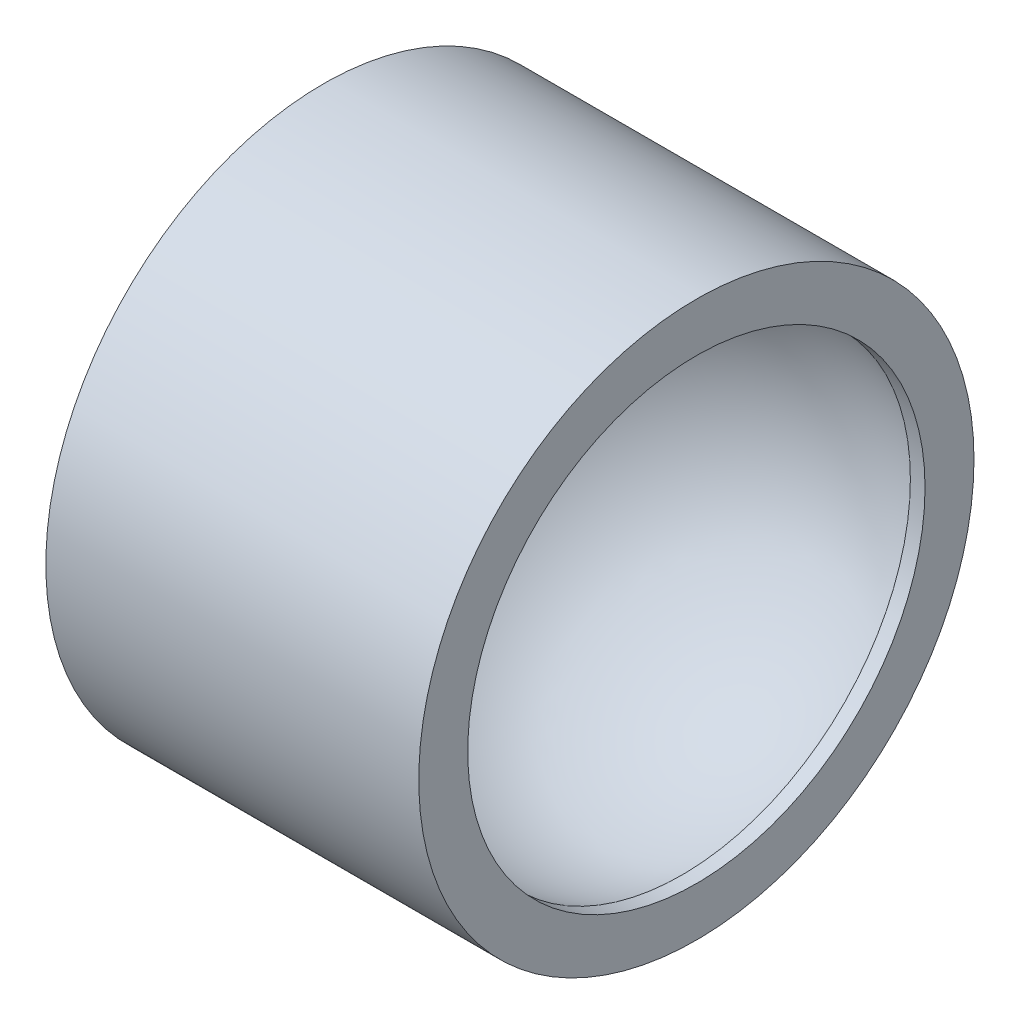
ISO-10303-21;
HEADER;
FILE_DESCRIPTION(('STEP AP214'),'2;1');
FILE_NAME('part.step','',(''),(''),'','','');
FILE_SCHEMA(('AUTOMOTIVE_DESIGN { 1 0 10303 214 1 1 1 1 }'));
ENDSEC;
DATA;
#1=APPLICATION_CONTEXT('core data for automotive mechanical design processes');
#2=APPLICATION_PROTOCOL_DEFINITION('international standard','automotive_design',2000,#1);
#3=PRODUCT_CONTEXT('',#1,'mechanical');
#4=PRODUCT('Part','Part','',(#3));
#5=PRODUCT_RELATED_PRODUCT_CATEGORY('part','',(#4));
#6=PRODUCT_DEFINITION_FORMATION('','',#4);
#7=PRODUCT_DEFINITION_CONTEXT('part definition',#1,'design');
#8=PRODUCT_DEFINITION('design','',#6,#7);
#9=PRODUCT_DEFINITION_SHAPE('','',#8);
#10=(LENGTH_UNIT() NAMED_UNIT(*) SI_UNIT(.MILLI.,.METRE.));
#11=(NAMED_UNIT(*) PLANE_ANGLE_UNIT() SI_UNIT($,.RADIAN.));
#12=(NAMED_UNIT(*) SI_UNIT($,.STERADIAN.) SOLID_ANGLE_UNIT());
#13=UNCERTAINTY_MEASURE_WITH_UNIT(LENGTH_MEASURE(1.E-05),#10,'distance_accuracy_value','');
#14=(GEOMETRIC_REPRESENTATION_CONTEXT(3) GLOBAL_UNCERTAINTY_ASSIGNED_CONTEXT((#13)) GLOBAL_UNIT_ASSIGNED_CONTEXT((#10,
#11,#12)) REPRESENTATION_CONTEXT('',''));
#15=CARTESIAN_POINT('',(0.,0.,0.));
#16=DIRECTION('',(0.,0.,1.));
#17=DIRECTION('',(1.,0.,0.));
#18=AXIS2_PLACEMENT_3D('',#15,#16,#17);
#19=CARTESIAN_POINT('',(-10.,0.,0.));
#20=DIRECTION('',(1.,0.,0.));
#21=DIRECTION('',(0.,0.,-1.));
#22=AXIS2_PLACEMENT_3D('',#19,#20,#21);
#23=CYLINDRICAL_SURFACE('',#22,9.57972369621136);
#24=CARTESIAN_POINT('',(3.48278351783399,0.,0.));
#25=DIRECTION('',(1.,0.,0.));
#26=DIRECTION('',(0.,0.,-1.));
#27=AXIS2_PLACEMENT_3D('',#24,#25,#26);
#28=CIRCLE('',#27,9.57972369621136);
#29=CARTESIAN_POINT('',(3.48278351783399,0.,-9.57972369621136));
#30=VERTEX_POINT('',#29);
#31=EDGE_CURVE('E10',#30,#30,#28,.T.);
#32=ORIENTED_EDGE('',*,*,#31,.T.);
#33=EDGE_LOOP('',(#32));
#34=FACE_BOUND('',#33,.T.);
#35=CARTESIAN_POINT('',(2.86860487070745,0.,0.));
#36=DIRECTION('',(1.,0.,0.));
#37=DIRECTION('',(0.,0.,-1.));
#38=AXIS2_PLACEMENT_3D('',#35,#36,#37);
#39=CIRCLE('',#38,9.57972369621136);
#40=CARTESIAN_POINT('',(2.86860487070745,0.,-9.57972369621136));
#41=VERTEX_POINT('',#40);
#42=EDGE_CURVE('E45',#41,#41,#39,.T.);
#43=ORIENTED_EDGE('',*,*,#42,.F.);
#44=EDGE_LOOP('',(#43));
#45=FACE_BOUND('',#44,.T.);
#46=ADVANCED_FACE('F31',(#34,#45),#23,.F.);
#47=CARTESIAN_POINT('',(3.48278351783399,0.,-11.630777084451));
#48=DIRECTION('',(1.,0.,0.));
#49=DIRECTION('',(0.,0.,-1.));
#50=AXIS2_PLACEMENT_3D('',#47,#48,#49);
#51=PLANE('',#50);
#52=CARTESIAN_POINT('',(3.48278351783399,0.,0.));
#53=DIRECTION('',(1.,0.,0.));
#54=DIRECTION('',(0.,0.,-1.));
#55=AXIS2_PLACEMENT_3D('',#52,#53,#54);
#56=CIRCLE('',#55,11.630777084451);
#57=CARTESIAN_POINT('',(3.48278351783399,0.,-11.630777084451));
#58=VERTEX_POINT('',#57);
#59=EDGE_CURVE('E37',#58,#58,#56,.T.);
#60=ORIENTED_EDGE('',*,*,#59,.T.);
#61=EDGE_LOOP('',(#60));
#62=FACE_BOUND('',#61,.T.);
#63=ORIENTED_EDGE('',*,*,#31,.F.);
#64=EDGE_LOOP('',(#63));
#65=FACE_BOUND('',#64,.T.);
#66=ADVANCED_FACE('F54',(#62,#65),#51,.T.);
#67=CARTESIAN_POINT('',(-10.,0.,0.));
#68=DIRECTION('',(1.,0.,0.));
#69=DIRECTION('',(0.,0.,-1.));
#70=AXIS2_PLACEMENT_3D('',#67,#68,#69);
#71=CYLINDRICAL_SURFACE('',#70,11.630777084451);
#72=CARTESIAN_POINT('',(-12.1410360604145,0.,0.));
#73=DIRECTION('',(1.,0.,0.));
#74=DIRECTION('',(0.,0.,-1.));
#75=AXIS2_PLACEMENT_3D('',#72,#73,#74);
#76=CIRCLE('',#75,11.630777084451);
#77=CARTESIAN_POINT('',(-12.1410360604145,0.,-11.630777084451));
#78=VERTEX_POINT('',#77);
#79=EDGE_CURVE('E41',#78,#78,#76,.T.);
#80=ORIENTED_EDGE('',*,*,#79,.T.);
#81=EDGE_LOOP('',(#80));
#82=FACE_BOUND('',#81,.T.);
#83=ORIENTED_EDGE('',*,*,#59,.F.);
#84=EDGE_LOOP('',(#83));
#85=FACE_BOUND('',#84,.T.);
#86=ADVANCED_FACE('F58',(#82,#85),#71,.T.);
#87=CARTESIAN_POINT('',(-12.1410360604145,0.,-11.630777084451));
#88=DIRECTION('',(-1.,0.,0.));
#89=DIRECTION('',(0.,0.,1.));
#90=AXIS2_PLACEMENT_3D('',#87,#88,#89);
#91=PLANE('',#90);
#92=ORIENTED_EDGE('',*,*,#79,.F.);
#93=EDGE_LOOP('',(#92));
#94=FACE_BOUND('',#93,.T.);
#95=ADVANCED_FACE('F62',(#94),#91,.T.);
#96=CARTESIAN_POINT('',(0.,0.,0.));
#97=DIRECTION('',(1.,0.,0.));
#98=DIRECTION('',(0.,0.,-1.));
#99=AXIS2_PLACEMENT_3D('',#96,#97,#98);
#100=SPHERICAL_SURFACE('',#99,10.);
#101=ORIENTED_EDGE('',*,*,#42,.T.);
#102=EDGE_LOOP('',(#101));
#103=FACE_BOUND('',#102,.T.);
#104=ADVANCED_FACE('F51',(#103),#100,.F.);
#105=CLOSED_SHELL('',(#46,#66,#86,#95,#104));
#106=MANIFOLD_SOLID_BREP('B2',#105);
#107=ADVANCED_BREP_SHAPE_REPRESENTATION('',(#18,#106),#14);
#108=SHAPE_DEFINITION_REPRESENTATION(#9,#107);
ENDSEC;
END-ISO-10303-21;
